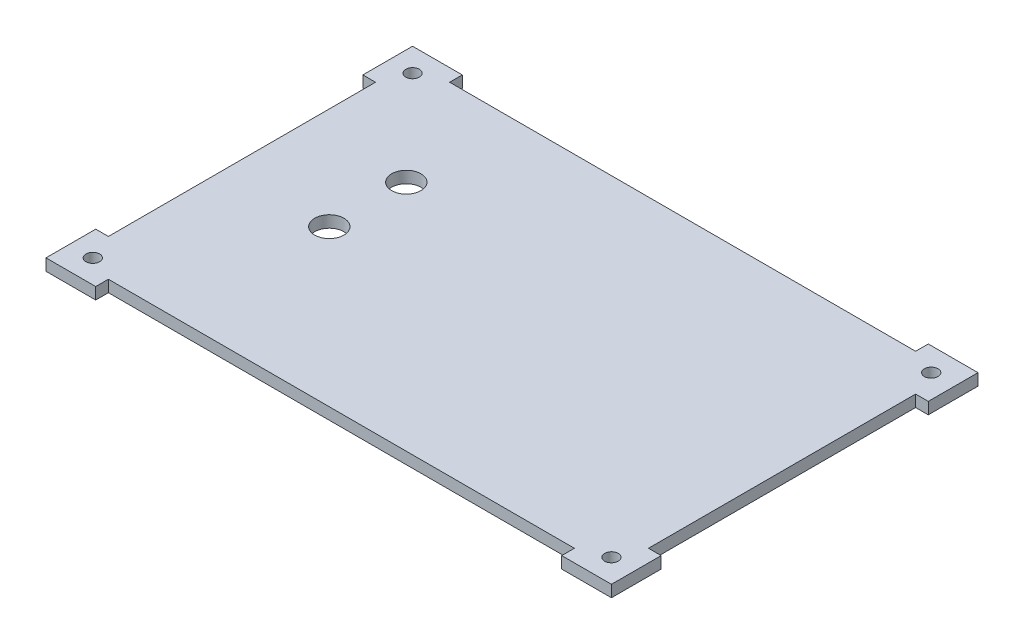
ISO-10303-21;
HEADER;
FILE_DESCRIPTION(('STEP AP214'),'2;1');
FILE_NAME('part.step','',(''),(''),'','','');
FILE_SCHEMA(('AUTOMOTIVE_DESIGN { 1 0 10303 214 1 1 1 1 }'));
ENDSEC;
DATA;
#1=APPLICATION_CONTEXT('core data for automotive mechanical design processes');
#2=APPLICATION_PROTOCOL_DEFINITION('international standard','automotive_design',2000,#1);
#3=PRODUCT_CONTEXT('',#1,'mechanical');
#4=PRODUCT('Part','Part','',(#3));
#5=PRODUCT_RELATED_PRODUCT_CATEGORY('part','',(#4));
#6=PRODUCT_DEFINITION_FORMATION('','',#4);
#7=PRODUCT_DEFINITION_CONTEXT('part definition',#1,'design');
#8=PRODUCT_DEFINITION('design','',#6,#7);
#9=PRODUCT_DEFINITION_SHAPE('','',#8);
#10=(LENGTH_UNIT() NAMED_UNIT(*) SI_UNIT(.MILLI.,.METRE.));
#11=(NAMED_UNIT(*) PLANE_ANGLE_UNIT() SI_UNIT($,.RADIAN.));
#12=(NAMED_UNIT(*) SI_UNIT($,.STERADIAN.) SOLID_ANGLE_UNIT());
#13=UNCERTAINTY_MEASURE_WITH_UNIT(LENGTH_MEASURE(1.E-05),#10,'distance_accuracy_value','');
#14=(GEOMETRIC_REPRESENTATION_CONTEXT(3) GLOBAL_UNCERTAINTY_ASSIGNED_CONTEXT((#13)) GLOBAL_UNIT_ASSIGNED_CONTEXT((#10,
#11,#12)) REPRESENTATION_CONTEXT('',''));
#15=CARTESIAN_POINT('',(0.,0.,0.));
#16=DIRECTION('',(0.,0.,1.));
#17=DIRECTION('',(1.,0.,0.));
#18=AXIS2_PLACEMENT_3D('',#15,#16,#17);
#19=CARTESIAN_POINT('',(0.,3.,87.5));
#20=DIRECTION('',(0.,0.,-1.));
#21=DIRECTION('',(-1.,0.,0.));
#22=AXIS2_PLACEMENT_3D('',#19,#20,#21);
#23=PLANE('',#22);
#24=DIRECTION('',(0.,-1.,0.));
#25=VECTOR('',#24,1.);
#26=CARTESIAN_POINT('',(129.,3.,87.5));
#27=LINE('',#26,#25);
#28=CARTESIAN_POINT('',(129.,3.,87.5));
#29=VERTEX_POINT('',#28);
#30=CARTESIAN_POINT('',(129.,0.,87.5));
#31=VERTEX_POINT('',#30);
#32=EDGE_CURVE('E62',#29,#31,#27,.T.);
#33=ORIENTED_EDGE('',*,*,#32,.F.);
#34=DIRECTION('',(1.,0.,0.));
#35=VECTOR('',#34,1.);
#36=CARTESIAN_POINT('',(0.,3.,87.5));
#37=LINE('',#36,#35);
#38=CARTESIAN_POINT('',(9.5,3.,87.5));
#39=VERTEX_POINT('',#38);
#40=EDGE_CURVE('E392',#39,#29,#37,.T.);
#41=ORIENTED_EDGE('',*,*,#40,.F.);
#42=DIRECTION('',(0.,-1.,0.));
#43=VECTOR('',#42,1.);
#44=CARTESIAN_POINT('',(9.5,3.,87.5));
#45=LINE('',#44,#43);
#46=CARTESIAN_POINT('',(9.5,0.,87.5));
#47=VERTEX_POINT('',#46);
#48=EDGE_CURVE('E336',#39,#47,#45,.T.);
#49=ORIENTED_EDGE('',*,*,#48,.T.);
#50=DIRECTION('',(1.,0.,0.));
#51=VECTOR('',#50,1.);
#52=CARTESIAN_POINT('',(0.,0.,87.5));
#53=LINE('',#52,#51);
#54=EDGE_CURVE('E222',#47,#31,#53,.T.);
#55=ORIENTED_EDGE('',*,*,#54,.T.);
#56=EDGE_LOOP('',(#33,#41,#49,#55));
#57=FACE_BOUND('',#56,.T.);
#58=ADVANCED_FACE('F37',(#57),#23,.F.);
#59=CARTESIAN_POINT('',(138.5,3.,0.));
#60=DIRECTION('',(-1.,0.,0.));
#61=DIRECTION('',(0.,0.,1.));
#62=AXIS2_PLACEMENT_3D('',#59,#60,#61);
#63=PLANE('',#62);
#64=DIRECTION('',(0.,0.,-1.));
#65=VECTOR('',#64,1.);
#66=CARTESIAN_POINT('',(138.5,3.,0.));
#67=LINE('',#66,#65);
#68=CARTESIAN_POINT('',(138.5,3.,78.));
#69=VERTEX_POINT('',#68);
#70=CARTESIAN_POINT('',(138.5,3.,9.5));
#71=VERTEX_POINT('',#70);
#72=EDGE_CURVE('E47',#69,#71,#67,.T.);
#73=ORIENTED_EDGE('',*,*,#72,.F.);
#74=DIRECTION('',(0.,-1.,0.));
#75=VECTOR('',#74,1.);
#76=CARTESIAN_POINT('',(138.5,3.,78.));
#77=LINE('',#76,#75);
#78=CARTESIAN_POINT('',(138.5,0.,78.));
#79=VERTEX_POINT('',#78);
#80=EDGE_CURVE('E195',#69,#79,#77,.T.);
#81=ORIENTED_EDGE('',*,*,#80,.T.);
#82=DIRECTION('',(0.,0.,-1.));
#83=VECTOR('',#82,1.);
#84=CARTESIAN_POINT('',(138.5,0.,0.));
#85=LINE('',#84,#83);
#86=CARTESIAN_POINT('',(138.5,0.,9.5));
#87=VERTEX_POINT('',#86);
#88=EDGE_CURVE('E225',#79,#87,#85,.T.);
#89=ORIENTED_EDGE('',*,*,#88,.T.);
#90=DIRECTION('',(0.,-1.,0.));
#91=VECTOR('',#90,1.);
#92=CARTESIAN_POINT('',(138.5,3.,9.5));
#93=LINE('',#92,#91);
#94=EDGE_CURVE('E272',#71,#87,#93,.T.);
#95=ORIENTED_EDGE('',*,*,#94,.F.);
#96=EDGE_LOOP('',(#73,#81,#89,#95));
#97=FACE_BOUND('',#96,.T.);
#98=ADVANCED_FACE('F396',(#97),#63,.F.);
#99=CARTESIAN_POINT('',(0.,3.,0.));
#100=DIRECTION('',(0.,0.,1.));
#101=DIRECTION('',(1.,0.,0.));
#102=AXIS2_PLACEMENT_3D('',#99,#100,#101);
#103=PLANE('',#102);
#104=DIRECTION('',(-1.,0.,0.));
#105=VECTOR('',#104,1.);
#106=CARTESIAN_POINT('',(0.,3.,0.));
#107=LINE('',#106,#105);
#108=CARTESIAN_POINT('',(129.,3.,0.));
#109=VERTEX_POINT('',#108);
#110=CARTESIAN_POINT('',(9.5,3.,0.));
#111=VERTEX_POINT('',#110);
#112=EDGE_CURVE('E12',#109,#111,#107,.T.);
#113=ORIENTED_EDGE('',*,*,#112,.F.);
#114=DIRECTION('',(0.,-1.,0.));
#115=VECTOR('',#114,1.);
#116=CARTESIAN_POINT('',(129.,3.,0.));
#117=LINE('',#116,#115);
#118=CARTESIAN_POINT('',(129.,0.,0.));
#119=VERTEX_POINT('',#118);
#120=EDGE_CURVE('E253',#109,#119,#117,.T.);
#121=ORIENTED_EDGE('',*,*,#120,.T.);
#122=DIRECTION('',(-1.,0.,0.));
#123=VECTOR('',#122,1.);
#124=CARTESIAN_POINT('',(0.,0.,0.));
#125=LINE('',#124,#123);
#126=CARTESIAN_POINT('',(9.5,0.,0.));
#127=VERTEX_POINT('',#126);
#128=EDGE_CURVE('E41',#119,#127,#125,.T.);
#129=ORIENTED_EDGE('',*,*,#128,.T.);
#130=DIRECTION('',(0.,-1.,0.));
#131=VECTOR('',#130,1.);
#132=CARTESIAN_POINT('',(9.5,3.,0.));
#133=LINE('',#132,#131);
#134=EDGE_CURVE('E319',#111,#127,#133,.T.);
#135=ORIENTED_EDGE('',*,*,#134,.F.);
#136=EDGE_LOOP('',(#113,#121,#129,#135));
#137=FACE_BOUND('',#136,.T.);
#138=ADVANCED_FACE('F419',(#137),#103,.F.);
#139=CARTESIAN_POINT('',(0.,3.,0.));
#140=DIRECTION('',(1.,0.,0.));
#141=DIRECTION('',(0.,0.,-1.));
#142=AXIS2_PLACEMENT_3D('',#139,#140,#141);
#143=PLANE('',#142);
#144=DIRECTION('',(0.,0.,1.));
#145=VECTOR('',#144,1.);
#146=CARTESIAN_POINT('',(0.,3.,0.));
#147=LINE('',#146,#145);
#148=CARTESIAN_POINT('',(0.,3.,9.5));
#149=VERTEX_POINT('',#148);
#150=CARTESIAN_POINT('',(0.,3.,78.));
#151=VERTEX_POINT('',#150);
#152=EDGE_CURVE('E390',#149,#151,#147,.T.);
#153=ORIENTED_EDGE('',*,*,#152,.F.);
#154=DIRECTION('',(0.,-1.,0.));
#155=VECTOR('',#154,1.);
#156=CARTESIAN_POINT('',(0.,3.,9.5));
#157=LINE('',#156,#155);
#158=CARTESIAN_POINT('',(0.,0.,9.5));
#159=VERTEX_POINT('',#158);
#160=EDGE_CURVE('E317',#149,#159,#157,.T.);
#161=ORIENTED_EDGE('',*,*,#160,.T.);
#162=DIRECTION('',(0.,0.,1.));
#163=VECTOR('',#162,1.);
#164=CARTESIAN_POINT('',(0.,0.,0.));
#165=LINE('',#164,#163);
#166=CARTESIAN_POINT('',(0.,0.,78.));
#167=VERTEX_POINT('',#166);
#168=EDGE_CURVE('E226',#159,#167,#165,.T.);
#169=ORIENTED_EDGE('',*,*,#168,.T.);
#170=DIRECTION('',(0.,-1.,0.));
#171=VECTOR('',#170,1.);
#172=CARTESIAN_POINT('',(0.,3.,78.));
#173=LINE('',#172,#171);
#174=EDGE_CURVE('E351',#151,#167,#173,.T.);
#175=ORIENTED_EDGE('',*,*,#174,.F.);
#176=EDGE_LOOP('',(#153,#161,#169,#175));
#177=FACE_BOUND('',#176,.T.);
#178=ADVANCED_FACE('F39',(#177),#143,.F.);
#179=CARTESIAN_POINT('',(0.,3.,0.));
#180=DIRECTION('',(0.,1.,0.));
#181=DIRECTION('',(0.,0.,1.));
#182=AXIS2_PLACEMENT_3D('',#179,#180,#181);
#183=PLANE('',#182);
#184=CARTESIAN_POINT('',(26.15,3.,47.5));
#185=DIRECTION('',(0.,-1.,0.));
#186=DIRECTION('',(0.,0.,-1.));
#187=AXIS2_PLACEMENT_3D('',#184,#185,#186);
#188=CIRCLE('',#187,3.75);
#189=CARTESIAN_POINT('',(26.15,3.,43.75));
#190=VERTEX_POINT('',#189);
#191=EDGE_CURVE('E210',#190,#190,#188,.T.);
#192=ORIENTED_EDGE('',*,*,#191,.T.);
#193=EDGE_LOOP('',(#192));
#194=FACE_BOUND('',#193,.T.);
#195=CARTESIAN_POINT('',(26.15,3.,27.75));
#196=DIRECTION('',(0.,-1.,0.));
#197=DIRECTION('',(0.,0.,-1.));
#198=AXIS2_PLACEMENT_3D('',#195,#196,#197);
#199=CIRCLE('',#198,3.75);
#200=CARTESIAN_POINT('',(26.15,3.,24.));
#201=VERTEX_POINT('',#200);
#202=EDGE_CURVE('E552',#201,#201,#199,.T.);
#203=ORIENTED_EDGE('',*,*,#202,.T.);
#204=EDGE_LOOP('',(#203));
#205=FACE_BOUND('',#204,.T.);
#206=DIRECTION('',(1.,0.,0.));
#207=VECTOR('',#206,1.);
#208=CARTESIAN_POINT('',(0.,3.,78.));
#209=LINE('',#208,#207);
#210=CARTESIAN_POINT('',(141.75,3.,78.));
#211=VERTEX_POINT('',#210);
#212=EDGE_CURVE('E181',#69,#211,#209,.T.);
#213=ORIENTED_EDGE('',*,*,#212,.F.);
#214=ORIENTED_EDGE('',*,*,#72,.T.);
#215=DIRECTION('',(1.,0.,0.));
#216=VECTOR('',#215,1.);
#217=CARTESIAN_POINT('',(0.,3.,9.5));
#218=LINE('',#217,#216);
#219=CARTESIAN_POINT('',(141.75,3.,9.5));
#220=VERTEX_POINT('',#219);
#221=EDGE_CURVE('E251',#71,#220,#218,.T.);
#222=ORIENTED_EDGE('',*,*,#221,.T.);
#223=DIRECTION('',(0.,0.,-1.));
#224=VECTOR('',#223,1.);
#225=CARTESIAN_POINT('',(141.75,3.,0.));
#226=LINE('',#225,#224);
#227=CARTESIAN_POINT('',(141.75,3.,-3.25));
#228=VERTEX_POINT('',#227);
#229=EDGE_CURVE('E249',#220,#228,#226,.T.);
#230=ORIENTED_EDGE('',*,*,#229,.T.);
#231=DIRECTION('',(-1.,0.,0.));
#232=VECTOR('',#231,1.);
#233=CARTESIAN_POINT('',(0.,3.,-3.25000000000002));
#234=LINE('',#233,#232);
#235=CARTESIAN_POINT('',(129.,3.,-3.25));
#236=VERTEX_POINT('',#235);
#237=EDGE_CURVE('E246',#228,#236,#234,.T.);
#238=ORIENTED_EDGE('',*,*,#237,.T.);
#239=DIRECTION('',(0.,0.,-1.));
#240=VECTOR('',#239,1.);
#241=CARTESIAN_POINT('',(129.,3.,0.));
#242=LINE('',#241,#240);
#243=EDGE_CURVE('E243',#109,#236,#242,.T.);
#244=ORIENTED_EDGE('',*,*,#243,.F.);
#245=ORIENTED_EDGE('',*,*,#112,.T.);
#246=DIRECTION('',(0.,0.,-1.));
#247=VECTOR('',#246,1.);
#248=CARTESIAN_POINT('',(9.5,3.,0.));
#249=LINE('',#248,#247);
#250=CARTESIAN_POINT('',(9.5,3.,-3.25));
#251=VERTEX_POINT('',#250);
#252=EDGE_CURVE('E291',#111,#251,#249,.T.);
#253=ORIENTED_EDGE('',*,*,#252,.T.);
#254=DIRECTION('',(1.,0.,0.));
#255=VECTOR('',#254,1.);
#256=CARTESIAN_POINT('',(0.,3.,-3.25));
#257=LINE('',#256,#255);
#258=CARTESIAN_POINT('',(-3.25,3.,-3.25));
#259=VERTEX_POINT('',#258);
#260=EDGE_CURVE('E287',#259,#251,#257,.T.);
#261=ORIENTED_EDGE('',*,*,#260,.F.);
#262=DIRECTION('',(0.,0.,1.));
#263=VECTOR('',#262,1.);
#264=CARTESIAN_POINT('',(-3.25,3.,0.));
#265=LINE('',#264,#263);
#266=CARTESIAN_POINT('',(-3.25,3.,9.5));
#267=VERTEX_POINT('',#266);
#268=EDGE_CURVE('E285',#259,#267,#265,.T.);
#269=ORIENTED_EDGE('',*,*,#268,.T.);
#270=DIRECTION('',(-1.,0.,0.));
#271=VECTOR('',#270,1.);
#272=CARTESIAN_POINT('',(0.,3.,9.5));
#273=LINE('',#272,#271);
#274=EDGE_CURVE('E293',#149,#267,#273,.T.);
#275=ORIENTED_EDGE('',*,*,#274,.F.);
#276=ORIENTED_EDGE('',*,*,#152,.T.);
#277=DIRECTION('',(1.,0.,0.));
#278=VECTOR('',#277,1.);
#279=CARTESIAN_POINT('',(0.,3.,78.));
#280=LINE('',#279,#278);
#281=CARTESIAN_POINT('',(-3.25,3.,78.));
#282=VERTEX_POINT('',#281);
#283=EDGE_CURVE('E334',#282,#151,#280,.T.);
#284=ORIENTED_EDGE('',*,*,#283,.F.);
#285=DIRECTION('',(0.,0.,-1.));
#286=VECTOR('',#285,1.);
#287=CARTESIAN_POINT('',(-3.24999999999999,3.,0.));
#288=LINE('',#287,#286);
#289=CARTESIAN_POINT('',(-3.25,3.,90.75));
#290=VERTEX_POINT('',#289);
#291=EDGE_CURVE('E331',#290,#282,#288,.T.);
#292=ORIENTED_EDGE('',*,*,#291,.F.);
#293=DIRECTION('',(1.,0.,0.));
#294=VECTOR('',#293,1.);
#295=CARTESIAN_POINT('',(0.,3.,90.75));
#296=LINE('',#295,#294);
#297=CARTESIAN_POINT('',(9.5,3.,90.75));
#298=VERTEX_POINT('',#297);
#299=EDGE_CURVE('E328',#290,#298,#296,.T.);
#300=ORIENTED_EDGE('',*,*,#299,.T.);
#301=DIRECTION('',(0.,0.,-1.));
#302=VECTOR('',#301,1.);
#303=CARTESIAN_POINT('',(9.5,3.,0.));
#304=LINE('',#303,#302);
#305=EDGE_CURVE('E325',#298,#39,#304,.T.);
#306=ORIENTED_EDGE('',*,*,#305,.T.);
#307=ORIENTED_EDGE('',*,*,#40,.T.);
#308=DIRECTION('',(0.,0.,1.));
#309=VECTOR('',#308,1.);
#310=CARTESIAN_POINT('',(129.,3.,0.));
#311=LINE('',#310,#309);
#312=CARTESIAN_POINT('',(129.,3.,90.75));
#313=VERTEX_POINT('',#312);
#314=EDGE_CURVE('E198',#29,#313,#311,.T.);
#315=ORIENTED_EDGE('',*,*,#314,.T.);
#316=DIRECTION('',(-1.,0.,0.));
#317=VECTOR('',#316,1.);
#318=CARTESIAN_POINT('',(0.,3.,90.75));
#319=LINE('',#318,#317);
#320=CARTESIAN_POINT('',(141.75,3.,90.75));
#321=VERTEX_POINT('',#320);
#322=EDGE_CURVE('E183',#321,#313,#319,.T.);
#323=ORIENTED_EDGE('',*,*,#322,.F.);
#324=DIRECTION('',(0.,0.,-1.));
#325=VECTOR('',#324,1.);
#326=CARTESIAN_POINT('',(141.75,3.,0.));
#327=LINE('',#326,#325);
#328=EDGE_CURVE('E176',#321,#211,#327,.T.);
#329=ORIENTED_EDGE('',*,*,#328,.T.);
#330=EDGE_LOOP('',(#213,#214,#222,#230,#238,#244,#245,#253,#261,#269,#275,#276,#284,#292,#300,
#306,#307,#315,#323,#329));
#331=FACE_BOUND('',#330,.T.);
#332=CARTESIAN_POINT('',(2.75,3.,2.74999999999997));
#333=DIRECTION('',(0.,-1.,0.));
#334=DIRECTION('',(0.,0.,-1.));
#335=AXIS2_PLACEMENT_3D('',#332,#333,#334);
#336=CIRCLE('',#335,1.75);
#337=CARTESIAN_POINT('',(2.75,3.,0.999999999999969));
#338=VERTEX_POINT('',#337);
#339=EDGE_CURVE('E380',#338,#338,#336,.T.);
#340=ORIENTED_EDGE('',*,*,#339,.T.);
#341=EDGE_LOOP('',(#340));
#342=FACE_BOUND('',#341,.T.);
#343=CARTESIAN_POINT('',(135.75,3.,2.74999999999997));
#344=DIRECTION('',(0.,-1.,0.));
#345=DIRECTION('',(0.,0.,-1.));
#346=AXIS2_PLACEMENT_3D('',#343,#344,#345);
#347=CIRCLE('',#346,1.75000000000001);
#348=CARTESIAN_POINT('',(135.75,3.,0.999999999999965));
#349=VERTEX_POINT('',#348);
#350=EDGE_CURVE('E372',#349,#349,#347,.T.);
#351=ORIENTED_EDGE('',*,*,#350,.T.);
#352=EDGE_LOOP('',(#351));
#353=FACE_BOUND('',#352,.T.);
#354=CARTESIAN_POINT('',(135.75,3.,84.75));
#355=DIRECTION('',(0.,-1.,0.));
#356=DIRECTION('',(0.,0.,-1.));
#357=AXIS2_PLACEMENT_3D('',#354,#355,#356);
#358=CIRCLE('',#357,1.75000000000001);
#359=CARTESIAN_POINT('',(135.75,3.,82.9999999999999));
#360=VERTEX_POINT('',#359);
#361=EDGE_CURVE('E364',#360,#360,#358,.T.);
#362=ORIENTED_EDGE('',*,*,#361,.T.);
#363=EDGE_LOOP('',(#362));
#364=FACE_BOUND('',#363,.T.);
#365=CARTESIAN_POINT('',(2.75,3.,84.75));
#366=DIRECTION('',(0.,-1.,0.));
#367=DIRECTION('',(0.,0.,-1.));
#368=AXIS2_PLACEMENT_3D('',#365,#366,#367);
#369=CIRCLE('',#368,1.75);
#370=CARTESIAN_POINT('',(2.75,3.,83.));
#371=VERTEX_POINT('',#370);
#372=EDGE_CURVE('E385',#371,#371,#369,.T.);
#373=ORIENTED_EDGE('',*,*,#372,.T.);
#374=EDGE_LOOP('',(#373));
#375=FACE_BOUND('',#374,.T.);
#376=ADVANCED_FACE('F178',(#194,#205,#331,#342,#353,#364,#375),#183,.T.);
#377=CARTESIAN_POINT('',(0.,0.,0.));
#378=DIRECTION('',(0.,1.,0.));
#379=DIRECTION('',(0.,0.,1.));
#380=AXIS2_PLACEMENT_3D('',#377,#378,#379);
#381=PLANE('',#380);
#382=CARTESIAN_POINT('',(26.15,0.,47.5));
#383=DIRECTION('',(0.,-1.,0.));
#384=DIRECTION('',(0.,0.,-1.));
#385=AXIS2_PLACEMENT_3D('',#382,#383,#384);
#386=CIRCLE('',#385,3.75);
#387=CARTESIAN_POINT('',(26.15,0.,43.75));
#388=VERTEX_POINT('',#387);
#389=EDGE_CURVE('E557',#388,#388,#386,.T.);
#390=ORIENTED_EDGE('',*,*,#389,.F.);
#391=EDGE_LOOP('',(#390));
#392=FACE_BOUND('',#391,.T.);
#393=CARTESIAN_POINT('',(26.15,0.,27.75));
#394=DIRECTION('',(0.,-1.,0.));
#395=DIRECTION('',(0.,0.,-1.));
#396=AXIS2_PLACEMENT_3D('',#393,#394,#395);
#397=CIRCLE('',#396,3.75);
#398=CARTESIAN_POINT('',(26.15,0.,24.));
#399=VERTEX_POINT('',#398);
#400=EDGE_CURVE('E555',#399,#399,#397,.T.);
#401=ORIENTED_EDGE('',*,*,#400,.F.);
#402=EDGE_LOOP('',(#401));
#403=FACE_BOUND('',#402,.T.);
#404=ORIENTED_EDGE('',*,*,#88,.F.);
#405=DIRECTION('',(1.,0.,0.));
#406=VECTOR('',#405,1.);
#407=CARTESIAN_POINT('',(0.,0.,78.));
#408=LINE('',#407,#406);
#409=CARTESIAN_POINT('',(141.75,0.,78.));
#410=VERTEX_POINT('',#409);
#411=EDGE_CURVE('E209',#79,#410,#408,.T.);
#412=ORIENTED_EDGE('',*,*,#411,.T.);
#413=DIRECTION('',(0.,0.,-1.));
#414=VECTOR('',#413,1.);
#415=CARTESIAN_POINT('',(141.75,0.,0.));
#416=LINE('',#415,#414);
#417=CARTESIAN_POINT('',(141.75,0.,90.75));
#418=VERTEX_POINT('',#417);
#419=EDGE_CURVE('E190',#418,#410,#416,.T.);
#420=ORIENTED_EDGE('',*,*,#419,.F.);
#421=DIRECTION('',(-1.,0.,0.));
#422=VECTOR('',#421,1.);
#423=CARTESIAN_POINT('',(0.,0.,90.75));
#424=LINE('',#423,#422);
#425=CARTESIAN_POINT('',(129.,0.,90.75));
#426=VERTEX_POINT('',#425);
#427=EDGE_CURVE('E200',#418,#426,#424,.T.);
#428=ORIENTED_EDGE('',*,*,#427,.T.);
#429=DIRECTION('',(0.,0.,1.));
#430=VECTOR('',#429,1.);
#431=CARTESIAN_POINT('',(129.,0.,0.));
#432=LINE('',#431,#430);
#433=EDGE_CURVE('E205',#31,#426,#432,.T.);
#434=ORIENTED_EDGE('',*,*,#433,.F.);
#435=ORIENTED_EDGE('',*,*,#54,.F.);
#436=DIRECTION('',(0.,0.,-1.));
#437=VECTOR('',#436,1.);
#438=CARTESIAN_POINT('',(9.5,0.,0.));
#439=LINE('',#438,#437);
#440=CARTESIAN_POINT('',(9.5,0.,90.75));
#441=VERTEX_POINT('',#440);
#442=EDGE_CURVE('E316',#441,#47,#439,.T.);
#443=ORIENTED_EDGE('',*,*,#442,.F.);
#444=DIRECTION('',(1.,0.,0.));
#445=VECTOR('',#444,1.);
#446=CARTESIAN_POINT('',(0.,0.,90.75));
#447=LINE('',#446,#445);
#448=CARTESIAN_POINT('',(-3.25,0.,90.75));
#449=VERTEX_POINT('',#448);
#450=EDGE_CURVE('E340',#449,#441,#447,.T.);
#451=ORIENTED_EDGE('',*,*,#450,.F.);
#452=DIRECTION('',(0.,0.,-1.));
#453=VECTOR('',#452,1.);
#454=CARTESIAN_POINT('',(-3.24999999999999,0.,0.));
#455=LINE('',#454,#453);
#456=CARTESIAN_POINT('',(-3.25,0.,78.));
#457=VERTEX_POINT('',#456);
#458=EDGE_CURVE('E343',#449,#457,#455,.T.);
#459=ORIENTED_EDGE('',*,*,#458,.T.);
#460=DIRECTION('',(1.,0.,0.));
#461=VECTOR('',#460,1.);
#462=CARTESIAN_POINT('',(0.,0.,78.));
#463=LINE('',#462,#461);
#464=EDGE_CURVE('E329',#457,#167,#463,.T.);
#465=ORIENTED_EDGE('',*,*,#464,.T.);
#466=ORIENTED_EDGE('',*,*,#168,.F.);
#467=DIRECTION('',(-1.,0.,0.));
#468=VECTOR('',#467,1.);
#469=CARTESIAN_POINT('',(0.,0.,9.5));
#470=LINE('',#469,#468);
#471=CARTESIAN_POINT('',(-3.25,0.,9.5));
#472=VERTEX_POINT('',#471);
#473=EDGE_CURVE('E288',#159,#472,#470,.T.);
#474=ORIENTED_EDGE('',*,*,#473,.T.);
#475=DIRECTION('',(0.,0.,1.));
#476=VECTOR('',#475,1.);
#477=CARTESIAN_POINT('',(-3.25,0.,0.));
#478=LINE('',#477,#476);
#479=CARTESIAN_POINT('',(-3.25,0.,-3.25));
#480=VERTEX_POINT('',#479);
#481=EDGE_CURVE('E275',#480,#472,#478,.T.);
#482=ORIENTED_EDGE('',*,*,#481,.F.);
#483=DIRECTION('',(1.,0.,0.));
#484=VECTOR('',#483,1.);
#485=CARTESIAN_POINT('',(0.,0.,-3.25));
#486=LINE('',#485,#484);
#487=CARTESIAN_POINT('',(9.5,0.,-3.25));
#488=VERTEX_POINT('',#487);
#489=EDGE_CURVE('E300',#480,#488,#486,.T.);
#490=ORIENTED_EDGE('',*,*,#489,.T.);
#491=DIRECTION('',(0.,0.,-1.));
#492=VECTOR('',#491,1.);
#493=CARTESIAN_POINT('',(9.5,0.,0.));
#494=LINE('',#493,#492);
#495=EDGE_CURVE('E308',#127,#488,#494,.T.);
#496=ORIENTED_EDGE('',*,*,#495,.F.);
#497=ORIENTED_EDGE('',*,*,#128,.F.);
#498=DIRECTION('',(0.,0.,-1.));
#499=VECTOR('',#498,1.);
#500=CARTESIAN_POINT('',(129.,0.,0.));
#501=LINE('',#500,#499);
#502=CARTESIAN_POINT('',(129.,0.,-3.25));
#503=VERTEX_POINT('',#502);
#504=EDGE_CURVE('E239',#119,#503,#501,.T.);
#505=ORIENTED_EDGE('',*,*,#504,.T.);
#506=DIRECTION('',(-1.,0.,0.));
#507=VECTOR('',#506,1.);
#508=CARTESIAN_POINT('',(0.,0.,-3.25000000000002));
#509=LINE('',#508,#507);
#510=CARTESIAN_POINT('',(141.75,0.,-3.25));
#511=VERTEX_POINT('',#510);
#512=EDGE_CURVE('E257',#511,#503,#509,.T.);
#513=ORIENTED_EDGE('',*,*,#512,.F.);
#514=DIRECTION('',(0.,0.,-1.));
#515=VECTOR('',#514,1.);
#516=CARTESIAN_POINT('',(141.75,0.,0.));
#517=LINE('',#516,#515);
#518=CARTESIAN_POINT('',(141.75,0.,9.5));
#519=VERTEX_POINT('',#518);
#520=EDGE_CURVE('E268',#519,#511,#517,.T.);
#521=ORIENTED_EDGE('',*,*,#520,.F.);
#522=DIRECTION('',(1.,0.,0.));
#523=VECTOR('',#522,1.);
#524=CARTESIAN_POINT('',(0.,0.,9.5));
#525=LINE('',#524,#523);
#526=EDGE_CURVE('E247',#87,#519,#525,.T.);
#527=ORIENTED_EDGE('',*,*,#526,.F.);
#528=EDGE_LOOP('',(#404,#412,#420,#428,#434,#435,#443,#451,#459,#465,#466,#474,#482,#490,#496,
#497,#505,#513,#521,#527));
#529=FACE_BOUND('',#528,.T.);
#530=CARTESIAN_POINT('',(2.75,0.,2.74999999999997));
#531=DIRECTION('',(0.,-1.,0.));
#532=DIRECTION('',(0.,0.,-1.));
#533=AXIS2_PLACEMENT_3D('',#530,#531,#532);
#534=CIRCLE('',#533,1.75);
#535=CARTESIAN_POINT('',(2.75,0.,0.999999999999969));
#536=VERTEX_POINT('',#535);
#537=EDGE_CURVE('E354',#536,#536,#534,.T.);
#538=ORIENTED_EDGE('',*,*,#537,.F.);
#539=EDGE_LOOP('',(#538));
#540=FACE_BOUND('',#539,.T.);
#541=CARTESIAN_POINT('',(135.75,0.,2.74999999999997));
#542=DIRECTION('',(0.,-1.,0.));
#543=DIRECTION('',(0.,0.,-1.));
#544=AXIS2_PLACEMENT_3D('',#541,#542,#543);
#545=CIRCLE('',#544,1.75000000000001);
#546=CARTESIAN_POINT('',(135.75,0.,0.999999999999965));
#547=VERTEX_POINT('',#546);
#548=EDGE_CURVE('E376',#547,#547,#545,.T.);
#549=ORIENTED_EDGE('',*,*,#548,.F.);
#550=EDGE_LOOP('',(#549));
#551=FACE_BOUND('',#550,.T.);
#552=CARTESIAN_POINT('',(135.75,0.,84.75));
#553=DIRECTION('',(0.,-1.,0.));
#554=DIRECTION('',(0.,0.,-1.));
#555=AXIS2_PLACEMENT_3D('',#552,#553,#554);
#556=CIRCLE('',#555,1.75000000000001);
#557=CARTESIAN_POINT('',(135.75,0.,82.9999999999999));
#558=VERTEX_POINT('',#557);
#559=EDGE_CURVE('E368',#558,#558,#556,.T.);
#560=ORIENTED_EDGE('',*,*,#559,.F.);
#561=EDGE_LOOP('',(#560));
#562=FACE_BOUND('',#561,.T.);
#563=CARTESIAN_POINT('',(2.75,0.,84.75));
#564=DIRECTION('',(0.,-1.,0.));
#565=DIRECTION('',(0.,0.,-1.));
#566=AXIS2_PLACEMENT_3D('',#563,#564,#565);
#567=CIRCLE('',#566,1.75);
#568=CARTESIAN_POINT('',(2.75,0.,83.));
#569=VERTEX_POINT('',#568);
#570=EDGE_CURVE('E367',#569,#569,#567,.T.);
#571=ORIENTED_EDGE('',*,*,#570,.F.);
#572=EDGE_LOOP('',(#571));
#573=FACE_BOUND('',#572,.T.);
#574=ADVANCED_FACE('F423',(#392,#403,#529,#540,#551,#562,#573),#381,.F.);
#575=CARTESIAN_POINT('',(2.75,3.,84.75));
#576=DIRECTION('',(0.,-1.,0.));
#577=DIRECTION('',(0.,0.,-1.));
#578=AXIS2_PLACEMENT_3D('',#575,#576,#577);
#579=CYLINDRICAL_SURFACE('',#578,1.75);
#580=ORIENTED_EDGE('',*,*,#372,.F.);
#581=EDGE_LOOP('',(#580));
#582=FACE_BOUND('',#581,.T.);
#583=ORIENTED_EDGE('',*,*,#570,.T.);
#584=EDGE_LOOP('',(#583));
#585=FACE_BOUND('',#584,.T.);
#586=ADVANCED_FACE('F493',(#582,#585),#579,.F.);
#587=CARTESIAN_POINT('',(135.75,3.,84.75));
#588=DIRECTION('',(0.,-1.,0.));
#589=DIRECTION('',(0.,0.,-1.));
#590=AXIS2_PLACEMENT_3D('',#587,#588,#589);
#591=CYLINDRICAL_SURFACE('',#590,1.75000000000001);
#592=ORIENTED_EDGE('',*,*,#361,.F.);
#593=EDGE_LOOP('',(#592));
#594=FACE_BOUND('',#593,.T.);
#595=ORIENTED_EDGE('',*,*,#559,.T.);
#596=EDGE_LOOP('',(#595));
#597=FACE_BOUND('',#596,.T.);
#598=ADVANCED_FACE('F500',(#594,#597),#591,.F.);
#599=CARTESIAN_POINT('',(135.75,3.,2.74999999999997));
#600=DIRECTION('',(0.,-1.,0.));
#601=DIRECTION('',(0.,0.,-1.));
#602=AXIS2_PLACEMENT_3D('',#599,#600,#601);
#603=CYLINDRICAL_SURFACE('',#602,1.75000000000001);
#604=ORIENTED_EDGE('',*,*,#350,.F.);
#605=EDGE_LOOP('',(#604));
#606=FACE_BOUND('',#605,.T.);
#607=ORIENTED_EDGE('',*,*,#548,.T.);
#608=EDGE_LOOP('',(#607));
#609=FACE_BOUND('',#608,.T.);
#610=ADVANCED_FACE('F505',(#606,#609),#603,.F.);
#611=CARTESIAN_POINT('',(2.75,3.,2.74999999999997));
#612=DIRECTION('',(0.,-1.,0.));
#613=DIRECTION('',(0.,0.,-1.));
#614=AXIS2_PLACEMENT_3D('',#611,#612,#613);
#615=CYLINDRICAL_SURFACE('',#614,1.75);
#616=ORIENTED_EDGE('',*,*,#339,.F.);
#617=EDGE_LOOP('',(#616));
#618=FACE_BOUND('',#617,.T.);
#619=ORIENTED_EDGE('',*,*,#537,.T.);
#620=EDGE_LOOP('',(#619));
#621=FACE_BOUND('',#620,.T.);
#622=ADVANCED_FACE('F502',(#618,#621),#615,.F.);
#623=CARTESIAN_POINT('',(0.,3.,78.));
#624=DIRECTION('',(0.,0.,-1.));
#625=DIRECTION('',(-1.,0.,0.));
#626=AXIS2_PLACEMENT_3D('',#623,#624,#625);
#627=PLANE('',#626);
#628=ORIENTED_EDGE('',*,*,#464,.F.);
#629=DIRECTION('',(0.,-1.,0.));
#630=VECTOR('',#629,1.);
#631=CARTESIAN_POINT('',(-3.25,3.,78.));
#632=LINE('',#631,#630);
#633=EDGE_CURVE('E355',#282,#457,#632,.T.);
#634=ORIENTED_EDGE('',*,*,#633,.F.);
#635=ORIENTED_EDGE('',*,*,#283,.T.);
#636=ORIENTED_EDGE('',*,*,#174,.T.);
#637=EDGE_LOOP('',(#628,#634,#635,#636));
#638=FACE_BOUND('',#637,.T.);
#639=ADVANCED_FACE('F451',(#638),#627,.T.);
#640=CARTESIAN_POINT('',(-3.24999999999999,3.,0.));
#641=DIRECTION('',(-1.,0.,0.));
#642=DIRECTION('',(0.,0.,1.));
#643=AXIS2_PLACEMENT_3D('',#640,#641,#642);
#644=PLANE('',#643);
#645=ORIENTED_EDGE('',*,*,#458,.F.);
#646=DIRECTION('',(0.,-1.,0.));
#647=VECTOR('',#646,1.);
#648=CARTESIAN_POINT('',(-3.25,3.,90.75));
#649=LINE('',#648,#647);
#650=EDGE_CURVE('E357',#290,#449,#649,.T.);
#651=ORIENTED_EDGE('',*,*,#650,.F.);
#652=ORIENTED_EDGE('',*,*,#291,.T.);
#653=ORIENTED_EDGE('',*,*,#633,.T.);
#654=EDGE_LOOP('',(#645,#651,#652,#653));
#655=FACE_BOUND('',#654,.T.);
#656=ADVANCED_FACE('F455',(#655),#644,.T.);
#657=CARTESIAN_POINT('',(0.,3.,90.75));
#658=DIRECTION('',(0.,0.,-1.));
#659=DIRECTION('',(-1.,0.,0.));
#660=AXIS2_PLACEMENT_3D('',#657,#658,#659);
#661=PLANE('',#660);
#662=ORIENTED_EDGE('',*,*,#450,.T.);
#663=DIRECTION('',(0.,-1.,0.));
#664=VECTOR('',#663,1.);
#665=CARTESIAN_POINT('',(9.5,3.,90.75));
#666=LINE('',#665,#664);
#667=EDGE_CURVE('E359',#298,#441,#666,.T.);
#668=ORIENTED_EDGE('',*,*,#667,.F.);
#669=ORIENTED_EDGE('',*,*,#299,.F.);
#670=ORIENTED_EDGE('',*,*,#650,.T.);
#671=EDGE_LOOP('',(#662,#668,#669,#670));
#672=FACE_BOUND('',#671,.T.);
#673=ADVANCED_FACE('F461',(#672),#661,.F.);
#674=CARTESIAN_POINT('',(9.5,3.,0.));
#675=DIRECTION('',(-1.,0.,0.));
#676=DIRECTION('',(0.,0.,1.));
#677=AXIS2_PLACEMENT_3D('',#674,#675,#676);
#678=PLANE('',#677);
#679=ORIENTED_EDGE('',*,*,#442,.T.);
#680=ORIENTED_EDGE('',*,*,#48,.F.);
#681=ORIENTED_EDGE('',*,*,#305,.F.);
#682=ORIENTED_EDGE('',*,*,#667,.T.);
#683=EDGE_LOOP('',(#679,#680,#681,#682));
#684=FACE_BOUND('',#683,.T.);
#685=ADVANCED_FACE('F465',(#684),#678,.F.);
#686=CARTESIAN_POINT('',(-3.25,3.,0.));
#687=DIRECTION('',(1.,0.,0.));
#688=DIRECTION('',(0.,0.,-1.));
#689=AXIS2_PLACEMENT_3D('',#686,#687,#688);
#690=PLANE('',#689);
#691=ORIENTED_EDGE('',*,*,#481,.T.);
#692=DIRECTION('',(0.,-1.,0.));
#693=VECTOR('',#692,1.);
#694=CARTESIAN_POINT('',(-3.25,3.,9.5));
#695=LINE('',#694,#693);
#696=EDGE_CURVE('E314',#267,#472,#695,.T.);
#697=ORIENTED_EDGE('',*,*,#696,.F.);
#698=ORIENTED_EDGE('',*,*,#268,.F.);
#699=DIRECTION('',(0.,-1.,0.));
#700=VECTOR('',#699,1.);
#701=CARTESIAN_POINT('',(-3.25,3.,-3.25));
#702=LINE('',#701,#700);
#703=EDGE_CURVE('E296',#259,#480,#702,.T.);
#704=ORIENTED_EDGE('',*,*,#703,.T.);
#705=EDGE_LOOP('',(#691,#697,#698,#704));
#706=FACE_BOUND('',#705,.T.);
#707=ADVANCED_FACE('F439',(#706),#690,.F.);
#708=CARTESIAN_POINT('',(0.,3.,9.5));
#709=DIRECTION('',(0.,0.,1.));
#710=DIRECTION('',(1.,0.,0.));
#711=AXIS2_PLACEMENT_3D('',#708,#709,#710);
#712=PLANE('',#711);
#713=ORIENTED_EDGE('',*,*,#473,.F.);
#714=ORIENTED_EDGE('',*,*,#160,.F.);
#715=ORIENTED_EDGE('',*,*,#274,.T.);
#716=ORIENTED_EDGE('',*,*,#696,.T.);
#717=EDGE_LOOP('',(#713,#714,#715,#716));
#718=FACE_BOUND('',#717,.T.);
#719=ADVANCED_FACE('F443',(#718),#712,.T.);
#720=CARTESIAN_POINT('',(9.5,3.,0.));
#721=DIRECTION('',(-1.,0.,0.));
#722=DIRECTION('',(0.,0.,1.));
#723=AXIS2_PLACEMENT_3D('',#720,#721,#722);
#724=PLANE('',#723);
#725=ORIENTED_EDGE('',*,*,#495,.T.);
#726=DIRECTION('',(0.,-1.,0.));
#727=VECTOR('',#726,1.);
#728=CARTESIAN_POINT('',(9.5,3.,-3.25));
#729=LINE('',#728,#727);
#730=EDGE_CURVE('E322',#251,#488,#729,.T.);
#731=ORIENTED_EDGE('',*,*,#730,.F.);
#732=ORIENTED_EDGE('',*,*,#252,.F.);
#733=ORIENTED_EDGE('',*,*,#134,.T.);
#734=EDGE_LOOP('',(#725,#731,#732,#733));
#735=FACE_BOUND('',#734,.T.);
#736=ADVANCED_FACE('F430',(#735),#724,.F.);
#737=CARTESIAN_POINT('',(0.,3.,-3.25));
#738=DIRECTION('',(0.,0.,-1.));
#739=DIRECTION('',(-1.,0.,0.));
#740=AXIS2_PLACEMENT_3D('',#737,#738,#739);
#741=PLANE('',#740);
#742=ORIENTED_EDGE('',*,*,#489,.F.);
#743=ORIENTED_EDGE('',*,*,#703,.F.);
#744=ORIENTED_EDGE('',*,*,#260,.T.);
#745=ORIENTED_EDGE('',*,*,#730,.T.);
#746=EDGE_LOOP('',(#742,#743,#744,#745));
#747=FACE_BOUND('',#746,.T.);
#748=ADVANCED_FACE('F437',(#747),#741,.T.);
#749=CARTESIAN_POINT('',(0.,3.,9.5));
#750=DIRECTION('',(0.,0.,-1.));
#751=DIRECTION('',(-1.,0.,0.));
#752=AXIS2_PLACEMENT_3D('',#749,#750,#751);
#753=PLANE('',#752);
#754=ORIENTED_EDGE('',*,*,#526,.T.);
#755=DIRECTION('',(0.,-1.,0.));
#756=VECTOR('',#755,1.);
#757=CARTESIAN_POINT('',(141.75,3.,9.5));
#758=LINE('',#757,#756);
#759=EDGE_CURVE('E276',#220,#519,#758,.T.);
#760=ORIENTED_EDGE('',*,*,#759,.F.);
#761=ORIENTED_EDGE('',*,*,#221,.F.);
#762=ORIENTED_EDGE('',*,*,#94,.T.);
#763=EDGE_LOOP('',(#754,#760,#761,#762));
#764=FACE_BOUND('',#763,.T.);
#765=ADVANCED_FACE('F400',(#764),#753,.F.);
#766=CARTESIAN_POINT('',(141.75,3.,0.));
#767=DIRECTION('',(-1.,0.,0.));
#768=DIRECTION('',(0.,0.,1.));
#769=AXIS2_PLACEMENT_3D('',#766,#767,#768);
#770=PLANE('',#769);
#771=ORIENTED_EDGE('',*,*,#520,.T.);
#772=DIRECTION('',(0.,-1.,0.));
#773=VECTOR('',#772,1.);
#774=CARTESIAN_POINT('',(141.75,3.,-3.25));
#775=LINE('',#774,#773);
#776=EDGE_CURVE('E279',#228,#511,#775,.T.);
#777=ORIENTED_EDGE('',*,*,#776,.F.);
#778=ORIENTED_EDGE('',*,*,#229,.F.);
#779=ORIENTED_EDGE('',*,*,#759,.T.);
#780=EDGE_LOOP('',(#771,#777,#778,#779));
#781=FACE_BOUND('',#780,.T.);
#782=ADVANCED_FACE('F405',(#781),#770,.F.);
#783=CARTESIAN_POINT('',(0.,3.,-3.25000000000002));
#784=DIRECTION('',(0.,0.,1.));
#785=DIRECTION('',(1.,0.,0.));
#786=AXIS2_PLACEMENT_3D('',#783,#784,#785);
#787=PLANE('',#786);
#788=ORIENTED_EDGE('',*,*,#512,.T.);
#789=DIRECTION('',(0.,-1.,0.));
#790=VECTOR('',#789,1.);
#791=CARTESIAN_POINT('',(129.,3.,-3.25));
#792=LINE('',#791,#790);
#793=EDGE_CURVE('E282',#236,#503,#792,.T.);
#794=ORIENTED_EDGE('',*,*,#793,.F.);
#795=ORIENTED_EDGE('',*,*,#237,.F.);
#796=ORIENTED_EDGE('',*,*,#776,.T.);
#797=EDGE_LOOP('',(#788,#794,#795,#796));
#798=FACE_BOUND('',#797,.T.);
#799=ADVANCED_FACE('F411',(#798),#787,.F.);
#800=CARTESIAN_POINT('',(129.,3.,0.));
#801=DIRECTION('',(-1.,0.,0.));
#802=DIRECTION('',(0.,0.,1.));
#803=AXIS2_PLACEMENT_3D('',#800,#801,#802);
#804=PLANE('',#803);
#805=ORIENTED_EDGE('',*,*,#504,.F.);
#806=ORIENTED_EDGE('',*,*,#120,.F.);
#807=ORIENTED_EDGE('',*,*,#243,.T.);
#808=ORIENTED_EDGE('',*,*,#793,.T.);
#809=EDGE_LOOP('',(#805,#806,#807,#808));
#810=FACE_BOUND('',#809,.T.);
#811=ADVANCED_FACE('F416',(#810),#804,.T.);
#812=CARTESIAN_POINT('',(129.,3.,0.));
#813=DIRECTION('',(1.,0.,0.));
#814=DIRECTION('',(0.,0.,-1.));
#815=AXIS2_PLACEMENT_3D('',#812,#813,#814);
#816=PLANE('',#815);
#817=ORIENTED_EDGE('',*,*,#433,.T.);
#818=DIRECTION('',(0.,-1.,0.));
#819=VECTOR('',#818,1.);
#820=CARTESIAN_POINT('',(129.,3.,90.75));
#821=LINE('',#820,#819);
#822=EDGE_CURVE('E237',#313,#426,#821,.T.);
#823=ORIENTED_EDGE('',*,*,#822,.F.);
#824=ORIENTED_EDGE('',*,*,#314,.F.);
#825=ORIENTED_EDGE('',*,*,#32,.T.);
#826=EDGE_LOOP('',(#817,#823,#824,#825));
#827=FACE_BOUND('',#826,.T.);
#828=ADVANCED_FACE('F469',(#827),#816,.F.);
#829=CARTESIAN_POINT('',(0.,3.,90.75));
#830=DIRECTION('',(0.,0.,1.));
#831=DIRECTION('',(1.,0.,0.));
#832=AXIS2_PLACEMENT_3D('',#829,#830,#831);
#833=PLANE('',#832);
#834=ORIENTED_EDGE('',*,*,#427,.F.);
#835=DIRECTION('',(0.,-1.,0.));
#836=VECTOR('',#835,1.);
#837=CARTESIAN_POINT('',(141.75,3.,90.75));
#838=LINE('',#837,#836);
#839=EDGE_CURVE('E194',#321,#418,#838,.T.);
#840=ORIENTED_EDGE('',*,*,#839,.F.);
#841=ORIENTED_EDGE('',*,*,#322,.T.);
#842=ORIENTED_EDGE('',*,*,#822,.T.);
#843=EDGE_LOOP('',(#834,#840,#841,#842));
#844=FACE_BOUND('',#843,.T.);
#845=ADVANCED_FACE('F473',(#844),#833,.T.);
#846=CARTESIAN_POINT('',(141.75,3.,0.));
#847=DIRECTION('',(-1.,0.,0.));
#848=DIRECTION('',(0.,0.,1.));
#849=AXIS2_PLACEMENT_3D('',#846,#847,#848);
#850=PLANE('',#849);
#851=ORIENTED_EDGE('',*,*,#419,.T.);
#852=DIRECTION('',(0.,-1.,0.));
#853=VECTOR('',#852,1.);
#854=CARTESIAN_POINT('',(141.75,3.,78.));
#855=LINE('',#854,#853);
#856=EDGE_CURVE('E187',#211,#410,#855,.T.);
#857=ORIENTED_EDGE('',*,*,#856,.F.);
#858=ORIENTED_EDGE('',*,*,#328,.F.);
#859=ORIENTED_EDGE('',*,*,#839,.T.);
#860=EDGE_LOOP('',(#851,#857,#858,#859));
#861=FACE_BOUND('',#860,.T.);
#862=ADVANCED_FACE('F188',(#861),#850,.F.);
#863=CARTESIAN_POINT('',(0.,3.,78.));
#864=DIRECTION('',(0.,0.,-1.));
#865=DIRECTION('',(-1.,0.,0.));
#866=AXIS2_PLACEMENT_3D('',#863,#864,#865);
#867=PLANE('',#866);
#868=ORIENTED_EDGE('',*,*,#411,.F.);
#869=ORIENTED_EDGE('',*,*,#80,.F.);
#870=ORIENTED_EDGE('',*,*,#212,.T.);
#871=ORIENTED_EDGE('',*,*,#856,.T.);
#872=EDGE_LOOP('',(#868,#869,#870,#871));
#873=FACE_BOUND('',#872,.T.);
#874=ADVANCED_FACE('F197',(#873),#867,.T.);
#875=CARTESIAN_POINT('',(26.15,3.,27.75));
#876=DIRECTION('',(0.,-1.,0.));
#877=DIRECTION('',(0.,0.,-1.));
#878=AXIS2_PLACEMENT_3D('',#875,#876,#877);
#879=CYLINDRICAL_SURFACE('',#878,3.75);
#880=ORIENTED_EDGE('',*,*,#202,.F.);
#881=EDGE_LOOP('',(#880));
#882=FACE_BOUND('',#881,.T.);
#883=ORIENTED_EDGE('',*,*,#400,.T.);
#884=EDGE_LOOP('',(#883));
#885=FACE_BOUND('',#884,.T.);
#886=ADVANCED_FACE('F538',(#882,#885),#879,.F.);
#887=CARTESIAN_POINT('',(26.15,3.,47.5));
#888=DIRECTION('',(0.,-1.,0.));
#889=DIRECTION('',(0.,0.,-1.));
#890=AXIS2_PLACEMENT_3D('',#887,#888,#889);
#891=CYLINDRICAL_SURFACE('',#890,3.75);
#892=ORIENTED_EDGE('',*,*,#191,.F.);
#893=EDGE_LOOP('',(#892));
#894=FACE_BOUND('',#893,.T.);
#895=ORIENTED_EDGE('',*,*,#389,.T.);
#896=EDGE_LOOP('',(#895));
#897=FACE_BOUND('',#896,.T.);
#898=ADVANCED_FACE('F542',(#894,#897),#891,.F.);
#899=CLOSED_SHELL('',(#58,#98,#138,#178,#376,#574,#586,#598,#610,#622,#639,#656,#673,#685,#707,
#719,#736,#748,#765,#782,#799,#811,#828,#845,#862,#874,#886,#898));
#900=MANIFOLD_SOLID_BREP('B2',#899);
#901=ADVANCED_BREP_SHAPE_REPRESENTATION('',(#18,#900),#14);
#902=SHAPE_DEFINITION_REPRESENTATION(#9,#901);
ENDSEC;
END-ISO-10303-21;
